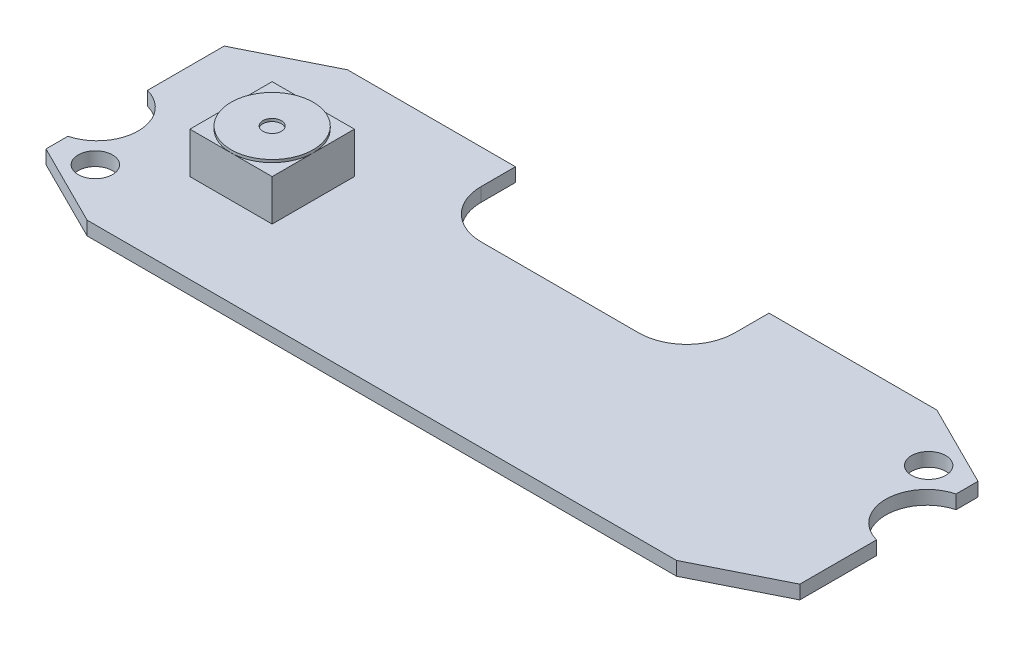
ISO-10303-21;
HEADER;
FILE_DESCRIPTION(('STEP AP214'),'2;1');
FILE_NAME('part.step','',(''),(''),'','','');
FILE_SCHEMA(('AUTOMOTIVE_DESIGN { 1 0 10303 214 1 1 1 1 }'));
ENDSEC;
DATA;
#1=APPLICATION_CONTEXT('core data for automotive mechanical design processes');
#2=APPLICATION_PROTOCOL_DEFINITION('international standard','automotive_design',2000,#1);
#3=PRODUCT_CONTEXT('',#1,'mechanical');
#4=PRODUCT('Part','Part','',(#3));
#5=PRODUCT_RELATED_PRODUCT_CATEGORY('part','',(#4));
#6=PRODUCT_DEFINITION_FORMATION('','',#4);
#7=PRODUCT_DEFINITION_CONTEXT('part definition',#1,'design');
#8=PRODUCT_DEFINITION('design','',#6,#7);
#9=PRODUCT_DEFINITION_SHAPE('','',#8);
#10=(LENGTH_UNIT() NAMED_UNIT(*) SI_UNIT(.MILLI.,.METRE.));
#11=(NAMED_UNIT(*) PLANE_ANGLE_UNIT() SI_UNIT($,.RADIAN.));
#12=(NAMED_UNIT(*) SI_UNIT($,.STERADIAN.) SOLID_ANGLE_UNIT());
#13=UNCERTAINTY_MEASURE_WITH_UNIT(LENGTH_MEASURE(1.E-05),#10,'distance_accuracy_value','');
#14=(GEOMETRIC_REPRESENTATION_CONTEXT(3) GLOBAL_UNCERTAINTY_ASSIGNED_CONTEXT((#13)) GLOBAL_UNIT_ASSIGNED_CONTEXT((#10,
#11,#12)) REPRESENTATION_CONTEXT('',''));
#15=CARTESIAN_POINT('',(0.,0.,0.));
#16=DIRECTION('',(0.,0.,1.));
#17=DIRECTION('',(1.,0.,0.));
#18=AXIS2_PLACEMENT_3D('',#15,#16,#17);
#19=CARTESIAN_POINT('',(0.,4.,0.));
#20=DIRECTION('',(0.,1.,0.));
#21=DIRECTION('',(0.,0.,1.));
#22=AXIS2_PLACEMENT_3D('',#19,#20,#21);
#23=PLANE('',#22);
#24=CARTESIAN_POINT('',(-17.5,4.,0.));
#25=DIRECTION('',(0.,1.,0.));
#26=DIRECTION('',(0.,0.,1.));
#27=AXIS2_PLACEMENT_3D('',#24,#25,#26);
#28=CIRCLE('',#27,3.);
#29=CARTESIAN_POINT('',(-17.5,4.,3.));
#30=VERTEX_POINT('',#29);
#31=CARTESIAN_POINT('',(-14.5,4.,0.));
#32=VERTEX_POINT('',#31);
#33=EDGE_CURVE('E136',#30,#32,#28,.T.);
#34=ORIENTED_EDGE('',*,*,#33,.F.);
#35=DIRECTION('',(1.,0.,0.));
#36=VECTOR('',#35,1.);
#37=CARTESIAN_POINT('',(0.,4.,3.));
#38=LINE('',#37,#36);
#39=CARTESIAN_POINT('',(-14.5,4.,3.));
#40=VERTEX_POINT('',#39);
#41=EDGE_CURVE('E296',#30,#40,#38,.T.);
#42=ORIENTED_EDGE('',*,*,#41,.T.);
#43=DIRECTION('',(0.,0.,-1.));
#44=VECTOR('',#43,1.);
#45=CARTESIAN_POINT('',(-14.5,4.,0.));
#46=LINE('',#45,#44);
#47=EDGE_CURVE('E308',#40,#32,#46,.T.);
#48=ORIENTED_EDGE('',*,*,#47,.T.);
#49=EDGE_LOOP('',(#34,#42,#48));
#50=FACE_BOUND('',#49,.T.);
#51=ADVANCED_FACE('F125',(#50),#23,.T.);
#52=CARTESIAN_POINT('',(-17.5,4.,-3.));
#53=VERTEX_POINT('',#52);
#54=EDGE_CURVE('E12',#32,#53,#28,.T.);
#55=ORIENTED_EDGE('',*,*,#54,.F.);
#56=CARTESIAN_POINT('',(-14.5,4.,-3.));
#57=VERTEX_POINT('',#56);
#58=EDGE_CURVE('E295',#32,#57,#46,.T.);
#59=ORIENTED_EDGE('',*,*,#58,.T.);
#60=DIRECTION('',(1.,0.,0.));
#61=VECTOR('',#60,1.);
#62=CARTESIAN_POINT('',(-20.5,4.,-3.));
#63=LINE('',#62,#61);
#64=EDGE_CURVE('E328',#53,#57,#63,.T.);
#65=ORIENTED_EDGE('',*,*,#64,.F.);
#66=EDGE_LOOP('',(#55,#59,#65));
#67=FACE_BOUND('',#66,.T.);
#68=ADVANCED_FACE('F506',(#67),#23,.T.);
#69=CARTESIAN_POINT('',(-20.5,4.,0.));
#70=VERTEX_POINT('',#69);
#71=EDGE_CURVE('E134',#53,#70,#28,.T.);
#72=ORIENTED_EDGE('',*,*,#71,.F.);
#73=CARTESIAN_POINT('',(-20.5,4.,-3.));
#74=VERTEX_POINT('',#73);
#75=EDGE_CURVE('E324',#74,#53,#63,.T.);
#76=ORIENTED_EDGE('',*,*,#75,.F.);
#77=DIRECTION('',(0.,0.,-1.));
#78=VECTOR('',#77,1.);
#79=CARTESIAN_POINT('',(-20.5,4.,0.));
#80=LINE('',#79,#78);
#81=EDGE_CURVE('E317',#70,#74,#80,.T.);
#82=ORIENTED_EDGE('',*,*,#81,.F.);
#83=EDGE_LOOP('',(#72,#76,#82));
#84=FACE_BOUND('',#83,.T.);
#85=ADVANCED_FACE('F510',(#84),#23,.T.);
#86=CARTESIAN_POINT('',(0.,1.,0.));
#87=DIRECTION('',(0.,1.,0.));
#88=DIRECTION('',(0.,0.,1.));
#89=AXIS2_PLACEMENT_3D('',#86,#87,#88);
#90=PLANE('',#89);
#91=CARTESIAN_POINT('',(-24.6999999517325,1.,5.70000020915926));
#92=DIRECTION('',(0.,1.,0.));
#93=DIRECTION('',(0.,0.,1.));
#94=AXIS2_PLACEMENT_3D('',#91,#92,#93);
#95=CIRCLE('',#94,1.25);
#96=CARTESIAN_POINT('',(-24.6999999517325,1.,6.95000020915926));
#97=VERTEX_POINT('',#96);
#98=EDGE_CURVE('E334',#97,#97,#95,.T.);
#99=ORIENTED_EDGE('',*,*,#98,.F.);
#100=EDGE_LOOP('',(#99));
#101=FACE_BOUND('',#100,.T.);
#102=CARTESIAN_POINT('',(24.7,1.,-5.7));
#103=DIRECTION('',(0.,1.,0.));
#104=DIRECTION('',(0.,0.,1.));
#105=AXIS2_PLACEMENT_3D('',#102,#103,#104);
#106=CIRCLE('',#105,1.25);
#107=CARTESIAN_POINT('',(24.7,1.,-4.45));
#108=VERTEX_POINT('',#107);
#109=EDGE_CURVE('E337',#108,#108,#106,.T.);
#110=ORIENTED_EDGE('',*,*,#109,.F.);
#111=EDGE_LOOP('',(#110));
#112=FACE_BOUND('',#111,.T.);
#113=DIRECTION('',(1.,0.,0.));
#114=VECTOR('',#113,1.);
#115=CARTESIAN_POINT('',(0.,1.,-3.5));
#116=LINE('',#115,#114);
#117=CARTESIAN_POINT('',(-5.74999999999997,1.,-3.5));
#118=VERTEX_POINT('',#117);
#119=CARTESIAN_POINT('',(5.74999999999997,1.,-3.5));
#120=VERTEX_POINT('',#119);
#121=EDGE_CURVE('E341',#118,#120,#116,.T.);
#122=ORIENTED_EDGE('',*,*,#121,.F.);
#123=CARTESIAN_POINT('',(-5.74999999999999,1.,-7.00000000000001));
#124=DIRECTION('',(0.,1.,0.));
#125=DIRECTION('',(0.,0.,1.));
#126=AXIS2_PLACEMENT_3D('',#123,#124,#125);
#127=CIRCLE('',#126,3.50000000000001);
#128=CARTESIAN_POINT('',(-9.25,1.,-7.00000000000003));
#129=VERTEX_POINT('',#128);
#130=EDGE_CURVE('E344',#118,#129,#127,.F.);
#131=ORIENTED_EDGE('',*,*,#130,.T.);
#132=DIRECTION('',(0.,0.,-1.));
#133=VECTOR('',#132,1.);
#134=CARTESIAN_POINT('',(-9.25,1.,0.));
#135=LINE('',#134,#133);
#136=CARTESIAN_POINT('',(-9.25,1.,-9.5));
#137=VERTEX_POINT('',#136);
#138=EDGE_CURVE('E347',#129,#137,#135,.T.);
#139=ORIENTED_EDGE('',*,*,#138,.T.);
#140=DIRECTION('',(1.,0.,0.));
#141=VECTOR('',#140,1.);
#142=CARTESIAN_POINT('',(0.,1.,-9.5));
#143=LINE('',#142,#141);
#144=CARTESIAN_POINT('',(-21.5,1.,-9.5));
#145=VERTEX_POINT('',#144);
#146=EDGE_CURVE('E349',#145,#137,#143,.T.);
#147=ORIENTED_EDGE('',*,*,#146,.F.);
#148=DIRECTION('',(-0.894427190999916,0.,0.447213595499958));
#149=VECTOR('',#148,1.);
#150=CARTESIAN_POINT('',(-8.1,1.,-16.2));
#151=LINE('',#150,#149);
#152=CARTESIAN_POINT('',(-27.5,1.,-6.5));
#153=VERTEX_POINT('',#152);
#154=EDGE_CURVE('E352',#145,#153,#151,.T.);
#155=ORIENTED_EDGE('',*,*,#154,.T.);
#156=DIRECTION('',(0.,0.,-1.));
#157=VECTOR('',#156,1.);
#158=CARTESIAN_POINT('',(-27.5,1.,0.));
#159=LINE('',#158,#157);
#160=CARTESIAN_POINT('',(-27.5,1.,-0.9));
#161=VERTEX_POINT('',#160);
#162=EDGE_CURVE('E354',#161,#153,#159,.T.);
#163=ORIENTED_EDGE('',*,*,#162,.F.);
#164=CARTESIAN_POINT('',(-28.2681145747869,1.,2.));
#165=DIRECTION('',(0.,1.,0.));
#166=DIRECTION('',(0.,0.,1.));
#167=AXIS2_PLACEMENT_3D('',#164,#165,#166);
#168=CIRCLE('',#167,3.);
#169=CARTESIAN_POINT('',(-27.5,1.,4.9));
#170=VERTEX_POINT('',#169);
#171=EDGE_CURVE('E357',#161,#170,#168,.F.);
#172=ORIENTED_EDGE('',*,*,#171,.T.);
#173=DIRECTION('',(0.,0.,-1.));
#174=VECTOR('',#173,1.);
#175=CARTESIAN_POINT('',(-27.5,1.,0.));
#176=LINE('',#175,#174);
#177=CARTESIAN_POINT('',(-27.5,1.,6.5));
#178=VERTEX_POINT('',#177);
#179=EDGE_CURVE('E359',#178,#170,#176,.T.);
#180=ORIENTED_EDGE('',*,*,#179,.F.);
#181=DIRECTION('',(-0.894427190999916,0.,-0.447213595499958));
#182=VECTOR('',#181,1.);
#183=CARTESIAN_POINT('',(-8.1,1.,16.2));
#184=LINE('',#183,#182);
#185=CARTESIAN_POINT('',(-21.5,1.,9.5));
#186=VERTEX_POINT('',#185);
#187=EDGE_CURVE('E362',#186,#178,#184,.T.);
#188=ORIENTED_EDGE('',*,*,#187,.F.);
#189=DIRECTION('',(1.,0.,0.));
#190=VECTOR('',#189,1.);
#191=CARTESIAN_POINT('',(0.,1.,9.5));
#192=LINE('',#191,#190);
#193=CARTESIAN_POINT('',(21.5,1.,9.5));
#194=VERTEX_POINT('',#193);
#195=EDGE_CURVE('E365',#186,#194,#192,.T.);
#196=ORIENTED_EDGE('',*,*,#195,.T.);
#197=DIRECTION('',(0.894427190999916,0.,-0.447213595499958));
#198=VECTOR('',#197,1.);
#199=CARTESIAN_POINT('',(8.1,1.,16.2));
#200=LINE('',#199,#198);
#201=CARTESIAN_POINT('',(27.5,1.,6.5));
#202=VERTEX_POINT('',#201);
#203=EDGE_CURVE('E368',#194,#202,#200,.T.);
#204=ORIENTED_EDGE('',*,*,#203,.T.);
#205=DIRECTION('',(0.,0.,-1.));
#206=VECTOR('',#205,1.);
#207=CARTESIAN_POINT('',(27.5,1.,0.));
#208=LINE('',#207,#206);
#209=CARTESIAN_POINT('',(27.5,1.,0.899999999999996));
#210=VERTEX_POINT('',#209);
#211=EDGE_CURVE('E371',#202,#210,#208,.T.);
#212=ORIENTED_EDGE('',*,*,#211,.T.);
#213=CARTESIAN_POINT('',(28.2681145747869,1.,-2.));
#214=DIRECTION('',(0.,1.,0.));
#215=DIRECTION('',(0.,0.,1.));
#216=AXIS2_PLACEMENT_3D('',#213,#214,#215);
#217=CIRCLE('',#216,3.);
#218=CARTESIAN_POINT('',(27.5,1.,-4.9));
#219=VERTEX_POINT('',#218);
#220=EDGE_CURVE('E374',#210,#219,#217,.F.);
#221=ORIENTED_EDGE('',*,*,#220,.T.);
#222=DIRECTION('',(0.,0.,-1.));
#223=VECTOR('',#222,1.);
#224=CARTESIAN_POINT('',(27.5,1.,0.));
#225=LINE('',#224,#223);
#226=CARTESIAN_POINT('',(27.5,1.,-6.5));
#227=VERTEX_POINT('',#226);
#228=EDGE_CURVE('E377',#219,#227,#225,.T.);
#229=ORIENTED_EDGE('',*,*,#228,.T.);
#230=DIRECTION('',(0.894427190999916,0.,0.447213595499958));
#231=VECTOR('',#230,1.);
#232=CARTESIAN_POINT('',(8.1,1.,-16.2));
#233=LINE('',#232,#231);
#234=CARTESIAN_POINT('',(21.5,1.,-9.5));
#235=VERTEX_POINT('',#234);
#236=EDGE_CURVE('E379',#235,#227,#233,.T.);
#237=ORIENTED_EDGE('',*,*,#236,.F.);
#238=DIRECTION('',(1.,0.,0.));
#239=VECTOR('',#238,1.);
#240=CARTESIAN_POINT('',(0.,1.,-9.5));
#241=LINE('',#240,#239);
#242=CARTESIAN_POINT('',(9.25,1.,-9.5));
#243=VERTEX_POINT('',#242);
#244=EDGE_CURVE('E382',#243,#235,#241,.T.);
#245=ORIENTED_EDGE('',*,*,#244,.F.);
#246=DIRECTION('',(0.,0.,-1.));
#247=VECTOR('',#246,1.);
#248=CARTESIAN_POINT('',(9.25,1.,0.));
#249=LINE('',#248,#247);
#250=CARTESIAN_POINT('',(9.25,1.,-7.00000000000003));
#251=VERTEX_POINT('',#250);
#252=EDGE_CURVE('E385',#251,#243,#249,.T.);
#253=ORIENTED_EDGE('',*,*,#252,.F.);
#254=CARTESIAN_POINT('',(5.74999999999999,1.,-7.00000000000001));
#255=DIRECTION('',(0.,1.,0.));
#256=DIRECTION('',(0.,0.,1.));
#257=AXIS2_PLACEMENT_3D('',#254,#255,#256);
#258=CIRCLE('',#257,3.50000000000001);
#259=EDGE_CURVE('E388',#120,#251,#258,.T.);
#260=ORIENTED_EDGE('',*,*,#259,.F.);
#261=EDGE_LOOP('',(#122,#131,#139,#147,#155,#163,#172,#180,#188,#196,#204,#212,#221,#229,#237,
#245,#253,#260));
#262=FACE_BOUND('',#261,.T.);
#263=DIRECTION('',(0.,0.,1.));
#264=VECTOR('',#263,1.);
#265=CARTESIAN_POINT('',(-14.5,1.,0.));
#266=LINE('',#265,#264);
#267=CARTESIAN_POINT('',(-14.5,1.,-3.));
#268=VERTEX_POINT('',#267);
#269=CARTESIAN_POINT('',(-14.5,1.,3.));
#270=VERTEX_POINT('',#269);
#271=EDGE_CURVE('E493',#268,#270,#266,.T.);
#272=ORIENTED_EDGE('',*,*,#271,.T.);
#273=DIRECTION('',(-1.,0.,0.));
#274=VECTOR('',#273,1.);
#275=CARTESIAN_POINT('',(0.,1.,3.));
#276=LINE('',#275,#274);
#277=CARTESIAN_POINT('',(-20.5,1.,3.));
#278=VERTEX_POINT('',#277);
#279=EDGE_CURVE('E129',#270,#278,#276,.T.);
#280=ORIENTED_EDGE('',*,*,#279,.T.);
#281=DIRECTION('',(0.,0.,1.));
#282=VECTOR('',#281,1.);
#283=CARTESIAN_POINT('',(-20.5,1.,0.));
#284=LINE('',#283,#282);
#285=CARTESIAN_POINT('',(-20.5,1.,-3.));
#286=VERTEX_POINT('',#285);
#287=EDGE_CURVE('E313',#286,#278,#284,.T.);
#288=ORIENTED_EDGE('',*,*,#287,.F.);
#289=DIRECTION('',(-1.,0.,0.));
#290=VECTOR('',#289,1.);
#291=CARTESIAN_POINT('',(0.,1.,-3.));
#292=LINE('',#291,#290);
#293=EDGE_CURVE('E490',#268,#286,#292,.T.);
#294=ORIENTED_EDGE('',*,*,#293,.F.);
#295=EDGE_LOOP('',(#272,#280,#288,#294));
#296=FACE_BOUND('',#295,.T.);
#297=ADVANCED_FACE('F512',(#101,#112,#262,#296),#90,.T.);
#298=CARTESIAN_POINT('',(-5.74999999999999,1.,-7.00000000000001));
#299=DIRECTION('',(0.,-1.,0.));
#300=DIRECTION('',(0.,0.,-1.));
#301=AXIS2_PLACEMENT_3D('',#298,#299,#300);
#302=CYLINDRICAL_SURFACE('',#301,3.50000000000001);
#303=CARTESIAN_POINT('',(-5.74999999999999,0.,-7.00000000000001));
#304=DIRECTION('',(0.,1.,0.));
#305=DIRECTION('',(0.,0.,1.));
#306=AXIS2_PLACEMENT_3D('',#303,#304,#305);
#307=CIRCLE('',#306,3.50000000000001);
#308=CARTESIAN_POINT('',(-5.74999999999997,0.,-3.5));
#309=VERTEX_POINT('',#308);
#310=CARTESIAN_POINT('',(-9.25,0.,-7.00000000000003));
#311=VERTEX_POINT('',#310);
#312=EDGE_CURVE('E400',#309,#311,#307,.F.);
#313=ORIENTED_EDGE('',*,*,#312,.T.);
#314=DIRECTION('',(0.,-1.,0.));
#315=VECTOR('',#314,1.);
#316=CARTESIAN_POINT('',(-9.25,1.,-7.00000000000003));
#317=LINE('',#316,#315);
#318=EDGE_CURVE('E485',#129,#311,#317,.T.);
#319=ORIENTED_EDGE('',*,*,#318,.F.);
#320=ORIENTED_EDGE('',*,*,#130,.F.);
#321=DIRECTION('',(0.,-1.,0.));
#322=VECTOR('',#321,1.);
#323=CARTESIAN_POINT('',(-5.74999999999997,1.,-3.5));
#324=LINE('',#323,#322);
#325=EDGE_CURVE('E488',#118,#309,#324,.T.);
#326=ORIENTED_EDGE('',*,*,#325,.T.);
#327=EDGE_LOOP('',(#313,#319,#320,#326));
#328=FACE_BOUND('',#327,.T.);
#329=ADVANCED_FACE('F518',(#328),#302,.F.);
#330=CARTESIAN_POINT('',(-9.25,1.,0.));
#331=DIRECTION('',(-1.,0.,0.));
#332=DIRECTION('',(0.,0.,1.));
#333=AXIS2_PLACEMENT_3D('',#330,#331,#332);
#334=PLANE('',#333);
#335=DIRECTION('',(0.,0.,-1.));
#336=VECTOR('',#335,1.);
#337=CARTESIAN_POINT('',(-9.25,0.,0.));
#338=LINE('',#337,#336);
#339=CARTESIAN_POINT('',(-9.25,0.,-9.5));
#340=VERTEX_POINT('',#339);
#341=EDGE_CURVE('E403',#311,#340,#338,.T.);
#342=ORIENTED_EDGE('',*,*,#341,.T.);
#343=DIRECTION('',(0.,-1.,0.));
#344=VECTOR('',#343,1.);
#345=CARTESIAN_POINT('',(-9.25,1.,-9.5));
#346=LINE('',#345,#344);
#347=EDGE_CURVE('E483',#137,#340,#346,.T.);
#348=ORIENTED_EDGE('',*,*,#347,.F.);
#349=ORIENTED_EDGE('',*,*,#138,.F.);
#350=ORIENTED_EDGE('',*,*,#318,.T.);
#351=EDGE_LOOP('',(#342,#348,#349,#350));
#352=FACE_BOUND('',#351,.T.);
#353=ADVANCED_FACE('F624',(#352),#334,.F.);
#354=CARTESIAN_POINT('',(0.,1.,-9.5));
#355=DIRECTION('',(0.,0.,-1.));
#356=DIRECTION('',(-1.,0.,0.));
#357=AXIS2_PLACEMENT_3D('',#354,#355,#356);
#358=PLANE('',#357);
#359=DIRECTION('',(1.,0.,0.));
#360=VECTOR('',#359,1.);
#361=CARTESIAN_POINT('',(0.,0.,-9.5));
#362=LINE('',#361,#360);
#363=CARTESIAN_POINT('',(-21.5,0.,-9.5));
#364=VERTEX_POINT('',#363);
#365=EDGE_CURVE('E406',#364,#340,#362,.T.);
#366=ORIENTED_EDGE('',*,*,#365,.F.);
#367=DIRECTION('',(0.,-1.,0.));
#368=VECTOR('',#367,1.);
#369=CARTESIAN_POINT('',(-21.5,1.,-9.5));
#370=LINE('',#369,#368);
#371=EDGE_CURVE('E481',#145,#364,#370,.T.);
#372=ORIENTED_EDGE('',*,*,#371,.F.);
#373=ORIENTED_EDGE('',*,*,#146,.T.);
#374=ORIENTED_EDGE('',*,*,#347,.T.);
#375=EDGE_LOOP('',(#366,#372,#373,#374));
#376=FACE_BOUND('',#375,.T.);
#377=ADVANCED_FACE('F620',(#376),#358,.T.);
#378=CARTESIAN_POINT('',(-8.1,1.,-16.2));
#379=DIRECTION('',(0.447213595499958,0.,0.894427190999916));
#380=DIRECTION('',(0.894427190999916,0.,-0.447213595499958));
#381=AXIS2_PLACEMENT_3D('',#378,#379,#380);
#382=PLANE('',#381);
#383=DIRECTION('',(-0.894427190999916,0.,0.447213595499958));
#384=VECTOR('',#383,1.);
#385=CARTESIAN_POINT('',(-8.1,0.,-16.2));
#386=LINE('',#385,#384);
#387=CARTESIAN_POINT('',(-27.5,0.,-6.5));
#388=VERTEX_POINT('',#387);
#389=EDGE_CURVE('E409',#364,#388,#386,.T.);
#390=ORIENTED_EDGE('',*,*,#389,.T.);
#391=DIRECTION('',(0.,-1.,0.));
#392=VECTOR('',#391,1.);
#393=CARTESIAN_POINT('',(-27.5,1.,-6.5));
#394=LINE('',#393,#392);
#395=EDGE_CURVE('E479',#153,#388,#394,.T.);
#396=ORIENTED_EDGE('',*,*,#395,.F.);
#397=ORIENTED_EDGE('',*,*,#154,.F.);
#398=ORIENTED_EDGE('',*,*,#371,.T.);
#399=EDGE_LOOP('',(#390,#396,#397,#398));
#400=FACE_BOUND('',#399,.T.);
#401=ADVANCED_FACE('F616',(#400),#382,.F.);
#402=CARTESIAN_POINT('',(-27.5,1.,0.));
#403=DIRECTION('',(-1.,0.,0.));
#404=DIRECTION('',(0.,0.,1.));
#405=AXIS2_PLACEMENT_3D('',#402,#403,#404);
#406=PLANE('',#405);
#407=DIRECTION('',(0.,0.,-1.));
#408=VECTOR('',#407,1.);
#409=CARTESIAN_POINT('',(-27.5,0.,0.));
#410=LINE('',#409,#408);
#411=CARTESIAN_POINT('',(-27.5,0.,-0.9));
#412=VERTEX_POINT('',#411);
#413=EDGE_CURVE('E412',#412,#388,#410,.T.);
#414=ORIENTED_EDGE('',*,*,#413,.F.);
#415=DIRECTION('',(0.,-1.,0.));
#416=VECTOR('',#415,1.);
#417=CARTESIAN_POINT('',(-27.5,1.,-0.9));
#418=LINE('',#417,#416);
#419=EDGE_CURVE('E477',#161,#412,#418,.T.);
#420=ORIENTED_EDGE('',*,*,#419,.F.);
#421=ORIENTED_EDGE('',*,*,#162,.T.);
#422=ORIENTED_EDGE('',*,*,#395,.T.);
#423=EDGE_LOOP('',(#414,#420,#421,#422));
#424=FACE_BOUND('',#423,.T.);
#425=ADVANCED_FACE('F612',(#424),#406,.T.);
#426=CARTESIAN_POINT('',(-28.2681145747869,1.,2.));
#427=DIRECTION('',(0.,-1.,0.));
#428=DIRECTION('',(0.,0.,-1.));
#429=AXIS2_PLACEMENT_3D('',#426,#427,#428);
#430=CYLINDRICAL_SURFACE('',#429,3.);
#431=CARTESIAN_POINT('',(-28.2681145747869,0.,2.));
#432=DIRECTION('',(0.,1.,0.));
#433=DIRECTION('',(0.,0.,1.));
#434=AXIS2_PLACEMENT_3D('',#431,#432,#433);
#435=CIRCLE('',#434,3.);
#436=CARTESIAN_POINT('',(-27.5,0.,4.9));
#437=VERTEX_POINT('',#436);
#438=EDGE_CURVE('E415',#412,#437,#435,.F.);
#439=ORIENTED_EDGE('',*,*,#438,.T.);
#440=DIRECTION('',(0.,-1.,0.));
#441=VECTOR('',#440,1.);
#442=CARTESIAN_POINT('',(-27.5,1.,4.9));
#443=LINE('',#442,#441);
#444=EDGE_CURVE('E475',#170,#437,#443,.T.);
#445=ORIENTED_EDGE('',*,*,#444,.F.);
#446=ORIENTED_EDGE('',*,*,#171,.F.);
#447=ORIENTED_EDGE('',*,*,#419,.T.);
#448=EDGE_LOOP('',(#439,#445,#446,#447));
#449=FACE_BOUND('',#448,.T.);
#450=ADVANCED_FACE('F608',(#449),#430,.F.);
#451=CARTESIAN_POINT('',(-27.5,1.,0.));
#452=DIRECTION('',(-1.,0.,0.));
#453=DIRECTION('',(0.,0.,1.));
#454=AXIS2_PLACEMENT_3D('',#451,#452,#453);
#455=PLANE('',#454);
#456=DIRECTION('',(0.,0.,-1.));
#457=VECTOR('',#456,1.);
#458=CARTESIAN_POINT('',(-27.5,0.,0.));
#459=LINE('',#458,#457);
#460=CARTESIAN_POINT('',(-27.5,0.,6.5));
#461=VERTEX_POINT('',#460);
#462=EDGE_CURVE('E418',#461,#437,#459,.T.);
#463=ORIENTED_EDGE('',*,*,#462,.F.);
#464=DIRECTION('',(0.,-1.,0.));
#465=VECTOR('',#464,1.);
#466=CARTESIAN_POINT('',(-27.5,1.,6.5));
#467=LINE('',#466,#465);
#468=EDGE_CURVE('E473',#178,#461,#467,.T.);
#469=ORIENTED_EDGE('',*,*,#468,.F.);
#470=ORIENTED_EDGE('',*,*,#179,.T.);
#471=ORIENTED_EDGE('',*,*,#444,.T.);
#472=EDGE_LOOP('',(#463,#469,#470,#471));
#473=FACE_BOUND('',#472,.T.);
#474=ADVANCED_FACE('F604',(#473),#455,.T.);
#475=CARTESIAN_POINT('',(-8.1,1.,16.2));
#476=DIRECTION('',(-0.447213595499958,0.,0.894427190999916));
#477=DIRECTION('',(0.894427190999916,0.,0.447213595499958));
#478=AXIS2_PLACEMENT_3D('',#475,#476,#477);
#479=PLANE('',#478);
#480=DIRECTION('',(-0.894427190999916,0.,-0.447213595499958));
#481=VECTOR('',#480,1.);
#482=CARTESIAN_POINT('',(-8.1,0.,16.2));
#483=LINE('',#482,#481);
#484=CARTESIAN_POINT('',(-21.5,0.,9.5));
#485=VERTEX_POINT('',#484);
#486=EDGE_CURVE('E421',#485,#461,#483,.T.);
#487=ORIENTED_EDGE('',*,*,#486,.F.);
#488=DIRECTION('',(0.,-1.,0.));
#489=VECTOR('',#488,1.);
#490=CARTESIAN_POINT('',(-21.5,1.,9.5));
#491=LINE('',#490,#489);
#492=EDGE_CURVE('E471',#186,#485,#491,.T.);
#493=ORIENTED_EDGE('',*,*,#492,.F.);
#494=ORIENTED_EDGE('',*,*,#187,.T.);
#495=ORIENTED_EDGE('',*,*,#468,.T.);
#496=EDGE_LOOP('',(#487,#493,#494,#495));
#497=FACE_BOUND('',#496,.T.);
#498=ADVANCED_FACE('F600',(#497),#479,.T.);
#499=CARTESIAN_POINT('',(0.,1.,9.5));
#500=DIRECTION('',(0.,0.,-1.));
#501=DIRECTION('',(-1.,0.,0.));
#502=AXIS2_PLACEMENT_3D('',#499,#500,#501);
#503=PLANE('',#502);
#504=DIRECTION('',(1.,0.,0.));
#505=VECTOR('',#504,1.);
#506=CARTESIAN_POINT('',(0.,0.,9.5));
#507=LINE('',#506,#505);
#508=CARTESIAN_POINT('',(21.5,0.,9.5));
#509=VERTEX_POINT('',#508);
#510=EDGE_CURVE('E424',#485,#509,#507,.T.);
#511=ORIENTED_EDGE('',*,*,#510,.T.);
#512=DIRECTION('',(0.,-1.,0.));
#513=VECTOR('',#512,1.);
#514=CARTESIAN_POINT('',(21.5,1.,9.5));
#515=LINE('',#514,#513);
#516=EDGE_CURVE('E468',#194,#509,#515,.T.);
#517=ORIENTED_EDGE('',*,*,#516,.F.);
#518=ORIENTED_EDGE('',*,*,#195,.F.);
#519=ORIENTED_EDGE('',*,*,#492,.T.);
#520=EDGE_LOOP('',(#511,#517,#518,#519));
#521=FACE_BOUND('',#520,.T.);
#522=ADVANCED_FACE('F596',(#521),#503,.F.);
#523=CARTESIAN_POINT('',(8.1,1.,16.2));
#524=DIRECTION('',(-0.447213595499958,0.,-0.894427190999916));
#525=DIRECTION('',(-0.894427190999916,0.,0.447213595499958));
#526=AXIS2_PLACEMENT_3D('',#523,#524,#525);
#527=PLANE('',#526);
#528=DIRECTION('',(0.894427190999916,0.,-0.447213595499958));
#529=VECTOR('',#528,1.);
#530=CARTESIAN_POINT('',(8.1,0.,16.2));
#531=LINE('',#530,#529);
#532=CARTESIAN_POINT('',(27.5,0.,6.5));
#533=VERTEX_POINT('',#532);
#534=EDGE_CURVE('E427',#509,#533,#531,.T.);
#535=ORIENTED_EDGE('',*,*,#534,.T.);
#536=DIRECTION('',(0.,-1.,0.));
#537=VECTOR('',#536,1.);
#538=CARTESIAN_POINT('',(27.5,1.,6.5));
#539=LINE('',#538,#537);
#540=EDGE_CURVE('E465',#202,#533,#539,.T.);
#541=ORIENTED_EDGE('',*,*,#540,.F.);
#542=ORIENTED_EDGE('',*,*,#203,.F.);
#543=ORIENTED_EDGE('',*,*,#516,.T.);
#544=EDGE_LOOP('',(#535,#541,#542,#543));
#545=FACE_BOUND('',#544,.T.);
#546=ADVANCED_FACE('F592',(#545),#527,.F.);
#547=CARTESIAN_POINT('',(27.5,1.,0.));
#548=DIRECTION('',(-1.,0.,0.));
#549=DIRECTION('',(0.,0.,1.));
#550=AXIS2_PLACEMENT_3D('',#547,#548,#549);
#551=PLANE('',#550);
#552=DIRECTION('',(0.,0.,-1.));
#553=VECTOR('',#552,1.);
#554=CARTESIAN_POINT('',(27.5,0.,0.));
#555=LINE('',#554,#553);
#556=CARTESIAN_POINT('',(27.5,0.,0.899999999999996));
#557=VERTEX_POINT('',#556);
#558=EDGE_CURVE('E430',#533,#557,#555,.T.);
#559=ORIENTED_EDGE('',*,*,#558,.T.);
#560=DIRECTION('',(0.,-1.,0.));
#561=VECTOR('',#560,1.);
#562=CARTESIAN_POINT('',(27.5,1.,0.899999999999996));
#563=LINE('',#562,#561);
#564=EDGE_CURVE('E462',#210,#557,#563,.T.);
#565=ORIENTED_EDGE('',*,*,#564,.F.);
#566=ORIENTED_EDGE('',*,*,#211,.F.);
#567=ORIENTED_EDGE('',*,*,#540,.T.);
#568=EDGE_LOOP('',(#559,#565,#566,#567));
#569=FACE_BOUND('',#568,.T.);
#570=ADVANCED_FACE('F588',(#569),#551,.F.);
#571=CARTESIAN_POINT('',(28.2681145747869,1.,-2.));
#572=DIRECTION('',(0.,-1.,0.));
#573=DIRECTION('',(0.,0.,-1.));
#574=AXIS2_PLACEMENT_3D('',#571,#572,#573);
#575=CYLINDRICAL_SURFACE('',#574,3.);
#576=CARTESIAN_POINT('',(28.2681145747869,0.,-2.));
#577=DIRECTION('',(0.,1.,0.));
#578=DIRECTION('',(0.,0.,1.));
#579=AXIS2_PLACEMENT_3D('',#576,#577,#578);
#580=CIRCLE('',#579,3.);
#581=CARTESIAN_POINT('',(27.5,0.,-4.9));
#582=VERTEX_POINT('',#581);
#583=EDGE_CURVE('E433',#557,#582,#580,.F.);
#584=ORIENTED_EDGE('',*,*,#583,.T.);
#585=DIRECTION('',(0.,-1.,0.));
#586=VECTOR('',#585,1.);
#587=CARTESIAN_POINT('',(27.5,1.,-4.9));
#588=LINE('',#587,#586);
#589=EDGE_CURVE('E459',#219,#582,#588,.T.);
#590=ORIENTED_EDGE('',*,*,#589,.F.);
#591=ORIENTED_EDGE('',*,*,#220,.F.);
#592=ORIENTED_EDGE('',*,*,#564,.T.);
#593=EDGE_LOOP('',(#584,#590,#591,#592));
#594=FACE_BOUND('',#593,.T.);
#595=ADVANCED_FACE('F584',(#594),#575,.F.);
#596=CARTESIAN_POINT('',(27.5,1.,0.));
#597=DIRECTION('',(-1.,0.,0.));
#598=DIRECTION('',(0.,0.,1.));
#599=AXIS2_PLACEMENT_3D('',#596,#597,#598);
#600=PLANE('',#599);
#601=DIRECTION('',(0.,0.,-1.));
#602=VECTOR('',#601,1.);
#603=CARTESIAN_POINT('',(27.5,0.,0.));
#604=LINE('',#603,#602);
#605=CARTESIAN_POINT('',(27.5,0.,-6.5));
#606=VERTEX_POINT('',#605);
#607=EDGE_CURVE('E436',#582,#606,#604,.T.);
#608=ORIENTED_EDGE('',*,*,#607,.T.);
#609=DIRECTION('',(0.,-1.,0.));
#610=VECTOR('',#609,1.);
#611=CARTESIAN_POINT('',(27.5,1.,-6.5));
#612=LINE('',#611,#610);
#613=EDGE_CURVE('E457',#227,#606,#612,.T.);
#614=ORIENTED_EDGE('',*,*,#613,.F.);
#615=ORIENTED_EDGE('',*,*,#228,.F.);
#616=ORIENTED_EDGE('',*,*,#589,.T.);
#617=EDGE_LOOP('',(#608,#614,#615,#616));
#618=FACE_BOUND('',#617,.T.);
#619=ADVANCED_FACE('F580',(#618),#600,.F.);
#620=CARTESIAN_POINT('',(8.1,1.,-16.2));
#621=DIRECTION('',(0.447213595499958,0.,-0.894427190999916));
#622=DIRECTION('',(-0.894427190999916,0.,-0.447213595499958));
#623=AXIS2_PLACEMENT_3D('',#620,#621,#622);
#624=PLANE('',#623);
#625=DIRECTION('',(0.894427190999916,0.,0.447213595499958));
#626=VECTOR('',#625,1.);
#627=CARTESIAN_POINT('',(8.1,0.,-16.2));
#628=LINE('',#627,#626);
#629=CARTESIAN_POINT('',(21.5,0.,-9.5));
#630=VERTEX_POINT('',#629);
#631=EDGE_CURVE('E439',#630,#606,#628,.T.);
#632=ORIENTED_EDGE('',*,*,#631,.F.);
#633=DIRECTION('',(0.,-1.,0.));
#634=VECTOR('',#633,1.);
#635=CARTESIAN_POINT('',(21.5,1.,-9.5));
#636=LINE('',#635,#634);
#637=EDGE_CURVE('E455',#235,#630,#636,.T.);
#638=ORIENTED_EDGE('',*,*,#637,.F.);
#639=ORIENTED_EDGE('',*,*,#236,.T.);
#640=ORIENTED_EDGE('',*,*,#613,.T.);
#641=EDGE_LOOP('',(#632,#638,#639,#640));
#642=FACE_BOUND('',#641,.T.);
#643=ADVANCED_FACE('F576',(#642),#624,.T.);
#644=CARTESIAN_POINT('',(0.,1.,-9.5));
#645=DIRECTION('',(0.,0.,-1.));
#646=DIRECTION('',(-1.,0.,0.));
#647=AXIS2_PLACEMENT_3D('',#644,#645,#646);
#648=PLANE('',#647);
#649=DIRECTION('',(1.,0.,0.));
#650=VECTOR('',#649,1.);
#651=CARTESIAN_POINT('',(0.,0.,-9.5));
#652=LINE('',#651,#650);
#653=CARTESIAN_POINT('',(9.25,0.,-9.5));
#654=VERTEX_POINT('',#653);
#655=EDGE_CURVE('E442',#654,#630,#652,.T.);
#656=ORIENTED_EDGE('',*,*,#655,.F.);
#657=DIRECTION('',(0.,-1.,0.));
#658=VECTOR('',#657,1.);
#659=CARTESIAN_POINT('',(9.25,1.,-9.5));
#660=LINE('',#659,#658);
#661=EDGE_CURVE('E453',#243,#654,#660,.T.);
#662=ORIENTED_EDGE('',*,*,#661,.F.);
#663=ORIENTED_EDGE('',*,*,#244,.T.);
#664=ORIENTED_EDGE('',*,*,#637,.T.);
#665=EDGE_LOOP('',(#656,#662,#663,#664));
#666=FACE_BOUND('',#665,.T.);
#667=ADVANCED_FACE('F572',(#666),#648,.T.);
#668=CARTESIAN_POINT('',(9.25,1.,0.));
#669=DIRECTION('',(-1.,0.,0.));
#670=DIRECTION('',(0.,0.,1.));
#671=AXIS2_PLACEMENT_3D('',#668,#669,#670);
#672=PLANE('',#671);
#673=DIRECTION('',(0.,0.,-1.));
#674=VECTOR('',#673,1.);
#675=CARTESIAN_POINT('',(9.25,0.,0.));
#676=LINE('',#675,#674);
#677=CARTESIAN_POINT('',(9.25,0.,-7.00000000000003));
#678=VERTEX_POINT('',#677);
#679=EDGE_CURVE('E445',#678,#654,#676,.T.);
#680=ORIENTED_EDGE('',*,*,#679,.F.);
#681=DIRECTION('',(0.,-1.,0.));
#682=VECTOR('',#681,1.);
#683=CARTESIAN_POINT('',(9.25,1.,-7.00000000000003));
#684=LINE('',#683,#682);
#685=EDGE_CURVE('E451',#251,#678,#684,.T.);
#686=ORIENTED_EDGE('',*,*,#685,.F.);
#687=ORIENTED_EDGE('',*,*,#252,.T.);
#688=ORIENTED_EDGE('',*,*,#661,.T.);
#689=EDGE_LOOP('',(#680,#686,#687,#688));
#690=FACE_BOUND('',#689,.T.);
#691=ADVANCED_FACE('F568',(#690),#672,.T.);
#692=CARTESIAN_POINT('',(5.74999999999999,1.,-7.00000000000001));
#693=DIRECTION('',(0.,-1.,0.));
#694=DIRECTION('',(0.,0.,-1.));
#695=AXIS2_PLACEMENT_3D('',#692,#693,#694);
#696=CYLINDRICAL_SURFACE('',#695,3.50000000000001);
#697=CARTESIAN_POINT('',(5.74999999999999,0.,-7.00000000000001));
#698=DIRECTION('',(0.,1.,0.));
#699=DIRECTION('',(0.,0.,1.));
#700=AXIS2_PLACEMENT_3D('',#697,#698,#699);
#701=CIRCLE('',#700,3.50000000000001);
#702=CARTESIAN_POINT('',(5.74999999999997,0.,-3.5));
#703=VERTEX_POINT('',#702);
#704=EDGE_CURVE('E338',#703,#678,#701,.T.);
#705=ORIENTED_EDGE('',*,*,#704,.F.);
#706=DIRECTION('',(0.,-1.,0.));
#707=VECTOR('',#706,1.);
#708=CARTESIAN_POINT('',(5.74999999999997,1.,-3.5));
#709=LINE('',#708,#707);
#710=EDGE_CURVE('E391',#120,#703,#709,.T.);
#711=ORIENTED_EDGE('',*,*,#710,.F.);
#712=ORIENTED_EDGE('',*,*,#259,.T.);
#713=ORIENTED_EDGE('',*,*,#685,.T.);
#714=EDGE_LOOP('',(#705,#711,#712,#713));
#715=FACE_BOUND('',#714,.T.);
#716=ADVANCED_FACE('F564',(#715),#696,.F.);
#717=CARTESIAN_POINT('',(0.,1.,-3.5));
#718=DIRECTION('',(0.,0.,-1.));
#719=DIRECTION('',(-1.,0.,0.));
#720=AXIS2_PLACEMENT_3D('',#717,#718,#719);
#721=PLANE('',#720);
#722=DIRECTION('',(1.,0.,0.));
#723=VECTOR('',#722,1.);
#724=CARTESIAN_POINT('',(0.,0.,-3.5));
#725=LINE('',#724,#723);
#726=EDGE_CURVE('E397',#309,#703,#725,.T.);
#727=ORIENTED_EDGE('',*,*,#726,.F.);
#728=ORIENTED_EDGE('',*,*,#325,.F.);
#729=ORIENTED_EDGE('',*,*,#121,.T.);
#730=ORIENTED_EDGE('',*,*,#710,.T.);
#731=EDGE_LOOP('',(#727,#728,#729,#730));
#732=FACE_BOUND('',#731,.T.);
#733=ADVANCED_FACE('F567',(#732),#721,.T.);
#734=CARTESIAN_POINT('',(24.7,1.,-5.7));
#735=DIRECTION('',(0.,-1.,0.));
#736=DIRECTION('',(0.,0.,-1.));
#737=AXIS2_PLACEMENT_3D('',#734,#735,#736);
#738=CYLINDRICAL_SURFACE('',#737,1.25);
#739=ORIENTED_EDGE('',*,*,#109,.T.);
#740=EDGE_LOOP('',(#739));
#741=FACE_BOUND('',#740,.T.);
#742=CARTESIAN_POINT('',(24.7,0.,-5.7));
#743=DIRECTION('',(0.,1.,0.));
#744=DIRECTION('',(0.,0.,1.));
#745=AXIS2_PLACEMENT_3D('',#742,#743,#744);
#746=CIRCLE('',#745,1.25);
#747=CARTESIAN_POINT('',(24.7,0.,-4.45));
#748=VERTEX_POINT('',#747);
#749=EDGE_CURVE('E394',#748,#748,#746,.T.);
#750=ORIENTED_EDGE('',*,*,#749,.F.);
#751=EDGE_LOOP('',(#750));
#752=FACE_BOUND('',#751,.T.);
#753=ADVANCED_FACE('F633',(#741,#752),#738,.F.);
#754=CARTESIAN_POINT('',(-24.6999999517325,1.,5.70000020915926));
#755=DIRECTION('',(0.,-1.,0.));
#756=DIRECTION('',(0.,0.,-1.));
#757=AXIS2_PLACEMENT_3D('',#754,#755,#756);
#758=CYLINDRICAL_SURFACE('',#757,1.25);
#759=ORIENTED_EDGE('',*,*,#98,.T.);
#760=EDGE_LOOP('',(#759));
#761=FACE_BOUND('',#760,.T.);
#762=CARTESIAN_POINT('',(-24.6999999517325,0.,5.70000020915926));
#763=DIRECTION('',(0.,1.,0.));
#764=DIRECTION('',(0.,0.,1.));
#765=AXIS2_PLACEMENT_3D('',#762,#763,#764);
#766=CIRCLE('',#765,1.25);
#767=CARTESIAN_POINT('',(-24.6999999517325,0.,6.95000020915926));
#768=VERTEX_POINT('',#767);
#769=EDGE_CURVE('E323',#768,#768,#766,.T.);
#770=ORIENTED_EDGE('',*,*,#769,.F.);
#771=EDGE_LOOP('',(#770));
#772=FACE_BOUND('',#771,.T.);
#773=ADVANCED_FACE('F127',(#761,#772),#758,.F.);
#774=CARTESIAN_POINT('',(0.,0.,0.));
#775=DIRECTION('',(0.,1.,0.));
#776=DIRECTION('',(0.,0.,1.));
#777=AXIS2_PLACEMENT_3D('',#774,#775,#776);
#778=PLANE('',#777);
#779=ORIENTED_EDGE('',*,*,#726,.T.);
#780=ORIENTED_EDGE('',*,*,#704,.T.);
#781=ORIENTED_EDGE('',*,*,#679,.T.);
#782=ORIENTED_EDGE('',*,*,#655,.T.);
#783=ORIENTED_EDGE('',*,*,#631,.T.);
#784=ORIENTED_EDGE('',*,*,#607,.F.);
#785=ORIENTED_EDGE('',*,*,#583,.F.);
#786=ORIENTED_EDGE('',*,*,#558,.F.);
#787=ORIENTED_EDGE('',*,*,#534,.F.);
#788=ORIENTED_EDGE('',*,*,#510,.F.);
#789=ORIENTED_EDGE('',*,*,#486,.T.);
#790=ORIENTED_EDGE('',*,*,#462,.T.);
#791=ORIENTED_EDGE('',*,*,#438,.F.);
#792=ORIENTED_EDGE('',*,*,#413,.T.);
#793=ORIENTED_EDGE('',*,*,#389,.F.);
#794=ORIENTED_EDGE('',*,*,#365,.T.);
#795=ORIENTED_EDGE('',*,*,#341,.F.);
#796=ORIENTED_EDGE('',*,*,#312,.F.);
#797=EDGE_LOOP('',(#779,#780,#781,#782,#783,#784,#785,#786,#787,#788,#789,#790,#791,#792,#793,
#794,#795,#796));
#798=FACE_BOUND('',#797,.T.);
#799=ORIENTED_EDGE('',*,*,#749,.T.);
#800=EDGE_LOOP('',(#799));
#801=FACE_BOUND('',#800,.T.);
#802=ORIENTED_EDGE('',*,*,#769,.T.);
#803=EDGE_LOOP('',(#802));
#804=FACE_BOUND('',#803,.T.);
#805=ADVANCED_FACE('F560',(#798,#801,#804),#778,.F.);
#806=CARTESIAN_POINT('',(-20.5,4.,0.));
#807=DIRECTION('',(-1.,0.,0.));
#808=DIRECTION('',(0.,0.,1.));
#809=AXIS2_PLACEMENT_3D('',#806,#807,#808);
#810=PLANE('',#809);
#811=DIRECTION('',(0.,-1.,0.));
#812=VECTOR('',#811,1.);
#813=CARTESIAN_POINT('',(-20.5,4.,-3.));
#814=LINE('',#813,#812);
#815=EDGE_CURVE('E327',#74,#286,#814,.T.);
#816=ORIENTED_EDGE('',*,*,#815,.T.);
#817=ORIENTED_EDGE('',*,*,#287,.T.);
#818=DIRECTION('',(0.,-1.,0.));
#819=VECTOR('',#818,1.);
#820=CARTESIAN_POINT('',(-20.5,4.,3.));
#821=LINE('',#820,#819);
#822=CARTESIAN_POINT('',(-20.5,4.,3.));
#823=VERTEX_POINT('',#822);
#824=EDGE_CURVE('E321',#823,#278,#821,.T.);
#825=ORIENTED_EDGE('',*,*,#824,.F.);
#826=EDGE_CURVE('E292',#823,#70,#80,.T.);
#827=ORIENTED_EDGE('',*,*,#826,.T.);
#828=ORIENTED_EDGE('',*,*,#81,.T.);
#829=EDGE_LOOP('',(#816,#817,#825,#827,#828));
#830=FACE_BOUND('',#829,.T.);
#831=ADVANCED_FACE('F496',(#830),#810,.T.);
#832=CARTESIAN_POINT('',(-14.5,4.,0.));
#833=DIRECTION('',(-1.,0.,0.));
#834=DIRECTION('',(0.,0.,1.));
#835=AXIS2_PLACEMENT_3D('',#832,#833,#834);
#836=PLANE('',#835);
#837=ORIENTED_EDGE('',*,*,#271,.F.);
#838=DIRECTION('',(0.,-1.,0.));
#839=VECTOR('',#838,1.);
#840=CARTESIAN_POINT('',(-14.5,4.,-3.));
#841=LINE('',#840,#839);
#842=EDGE_CURVE('E331',#57,#268,#841,.T.);
#843=ORIENTED_EDGE('',*,*,#842,.F.);
#844=ORIENTED_EDGE('',*,*,#58,.F.);
#845=ORIENTED_EDGE('',*,*,#47,.F.);
#846=DIRECTION('',(0.,-1.,0.));
#847=VECTOR('',#846,1.);
#848=CARTESIAN_POINT('',(-14.5,4.,3.));
#849=LINE('',#848,#847);
#850=EDGE_CURVE('E303',#40,#270,#849,.T.);
#851=ORIENTED_EDGE('',*,*,#850,.T.);
#852=EDGE_LOOP('',(#837,#843,#844,#845,#851));
#853=FACE_BOUND('',#852,.T.);
#854=ADVANCED_FACE('F501',(#853),#836,.F.);
#855=CARTESIAN_POINT('',(0.,4.,3.));
#856=DIRECTION('',(0.,0.,-1.));
#857=DIRECTION('',(-1.,0.,0.));
#858=AXIS2_PLACEMENT_3D('',#855,#856,#857);
#859=PLANE('',#858);
#860=ORIENTED_EDGE('',*,*,#279,.F.);
#861=ORIENTED_EDGE('',*,*,#850,.F.);
#862=ORIENTED_EDGE('',*,*,#41,.F.);
#863=EDGE_CURVE('E288',#823,#30,#38,.T.);
#864=ORIENTED_EDGE('',*,*,#863,.F.);
#865=ORIENTED_EDGE('',*,*,#824,.T.);
#866=EDGE_LOOP('',(#860,#861,#862,#864,#865));
#867=FACE_BOUND('',#866,.T.);
#868=ADVANCED_FACE('F301',(#867),#859,.F.);
#869=EDGE_CURVE('E143',#70,#30,#28,.T.);
#870=ORIENTED_EDGE('',*,*,#869,.F.);
#871=ORIENTED_EDGE('',*,*,#826,.F.);
#872=ORIENTED_EDGE('',*,*,#863,.T.);
#873=EDGE_LOOP('',(#870,#871,#872));
#874=FACE_BOUND('',#873,.T.);
#875=ADVANCED_FACE('F290',(#874),#23,.T.);
#876=CARTESIAN_POINT('',(-20.5,4.,-3.));
#877=DIRECTION('',(0.,0.,-1.));
#878=DIRECTION('',(-1.,0.,0.));
#879=AXIS2_PLACEMENT_3D('',#876,#877,#878);
#880=PLANE('',#879);
#881=ORIENTED_EDGE('',*,*,#842,.T.);
#882=ORIENTED_EDGE('',*,*,#293,.T.);
#883=ORIENTED_EDGE('',*,*,#815,.F.);
#884=ORIENTED_EDGE('',*,*,#75,.T.);
#885=ORIENTED_EDGE('',*,*,#64,.T.);
#886=EDGE_LOOP('',(#881,#882,#883,#884,#885));
#887=FACE_BOUND('',#886,.T.);
#888=ADVANCED_FACE('F509',(#887),#880,.T.);
#889=CARTESIAN_POINT('',(-17.5,4.2,0.));
#890=DIRECTION('',(0.,-1.,0.));
#891=DIRECTION('',(0.,0.,-1.));
#892=AXIS2_PLACEMENT_3D('',#889,#890,#891);
#893=CYLINDRICAL_SURFACE('',#892,0.674999999999999);
#894=CARTESIAN_POINT('',(-17.5,4.2,0.));
#895=DIRECTION('',(0.,1.,0.));
#896=DIRECTION('',(0.,0.,1.));
#897=AXIS2_PLACEMENT_3D('',#894,#895,#896);
#898=CIRCLE('',#897,0.674999999999999);
#899=CARTESIAN_POINT('',(-17.5,4.2,0.674999999999999));
#900=VERTEX_POINT('',#899);
#901=EDGE_CURVE('E310',#900,#900,#898,.T.);
#902=ORIENTED_EDGE('',*,*,#901,.T.);
#903=EDGE_LOOP('',(#902));
#904=FACE_BOUND('',#903,.T.);
#905=CARTESIAN_POINT('',(-17.5,4.,0.));
#906=DIRECTION('',(0.,1.,0.));
#907=DIRECTION('',(0.,0.,1.));
#908=AXIS2_PLACEMENT_3D('',#905,#906,#907);
#909=CIRCLE('',#908,0.674999999999999);
#910=CARTESIAN_POINT('',(-17.5,4.,0.674999999999999));
#911=VERTEX_POINT('',#910);
#912=EDGE_CURVE('E311',#911,#911,#909,.T.);
#913=ORIENTED_EDGE('',*,*,#912,.F.);
#914=EDGE_LOOP('',(#913));
#915=FACE_BOUND('',#914,.T.);
#916=ADVANCED_FACE('F539',(#904,#915),#893,.F.);
#917=CARTESIAN_POINT('',(-17.5,4.2,0.));
#918=DIRECTION('',(0.,-1.,0.));
#919=DIRECTION('',(0.,0.,-1.));
#920=AXIS2_PLACEMENT_3D('',#917,#918,#919);
#921=CYLINDRICAL_SURFACE('',#920,3.);
#922=CARTESIAN_POINT('',(-17.5,4.2,0.));
#923=DIRECTION('',(0.,1.,0.));
#924=DIRECTION('',(0.,0.,1.));
#925=AXIS2_PLACEMENT_3D('',#922,#923,#924);
#926=CIRCLE('',#925,3.);
#927=CARTESIAN_POINT('',(-17.5,4.2,3.));
#928=VERTEX_POINT('',#927);
#929=EDGE_CURVE('E508',#928,#928,#926,.T.);
#930=ORIENTED_EDGE('',*,*,#929,.F.);
#931=EDGE_LOOP('',(#930));
#932=FACE_BOUND('',#931,.T.);
#933=ORIENTED_EDGE('',*,*,#33,.T.);
#934=ORIENTED_EDGE('',*,*,#54,.T.);
#935=ORIENTED_EDGE('',*,*,#71,.T.);
#936=ORIENTED_EDGE('',*,*,#869,.T.);
#937=EDGE_LOOP('',(#933,#934,#935,#936));
#938=FACE_BOUND('',#937,.T.);
#939=ADVANCED_FACE('F312',(#932,#938),#921,.T.);
#940=CARTESIAN_POINT('',(0.,4.2,0.));
#941=DIRECTION('',(0.,1.,0.));
#942=DIRECTION('',(0.,0.,1.));
#943=AXIS2_PLACEMENT_3D('',#940,#941,#942);
#944=PLANE('',#943);
#945=ORIENTED_EDGE('',*,*,#901,.F.);
#946=EDGE_LOOP('',(#945));
#947=FACE_BOUND('',#946,.T.);
#948=ORIENTED_EDGE('',*,*,#929,.T.);
#949=EDGE_LOOP('',(#948));
#950=FACE_BOUND('',#949,.T.);
#951=ADVANCED_FACE('F529',(#947,#950),#944,.T.);
#952=ORIENTED_EDGE('',*,*,#912,.T.);
#953=EDGE_LOOP('',(#952));
#954=FACE_BOUND('',#953,.T.);
#955=ADVANCED_FACE('F524',(#954),#23,.T.);
#956=CLOSED_SHELL('',(#51,#68,#85,#297,#329,#353,#377,#401,#425,#450,#474,#498,#522,#546,#570,
#595,#619,#643,#667,#691,#716,#733,#753,#773,#805,#831,#854,#868,#875,#888,#916,#939,#951,#955));
#957=MANIFOLD_SOLID_BREP('B2',#956);
#958=ADVANCED_BREP_SHAPE_REPRESENTATION('',(#18,#957),#14);
#959=SHAPE_DEFINITION_REPRESENTATION(#9,#958);
ENDSEC;
END-ISO-10303-21;
